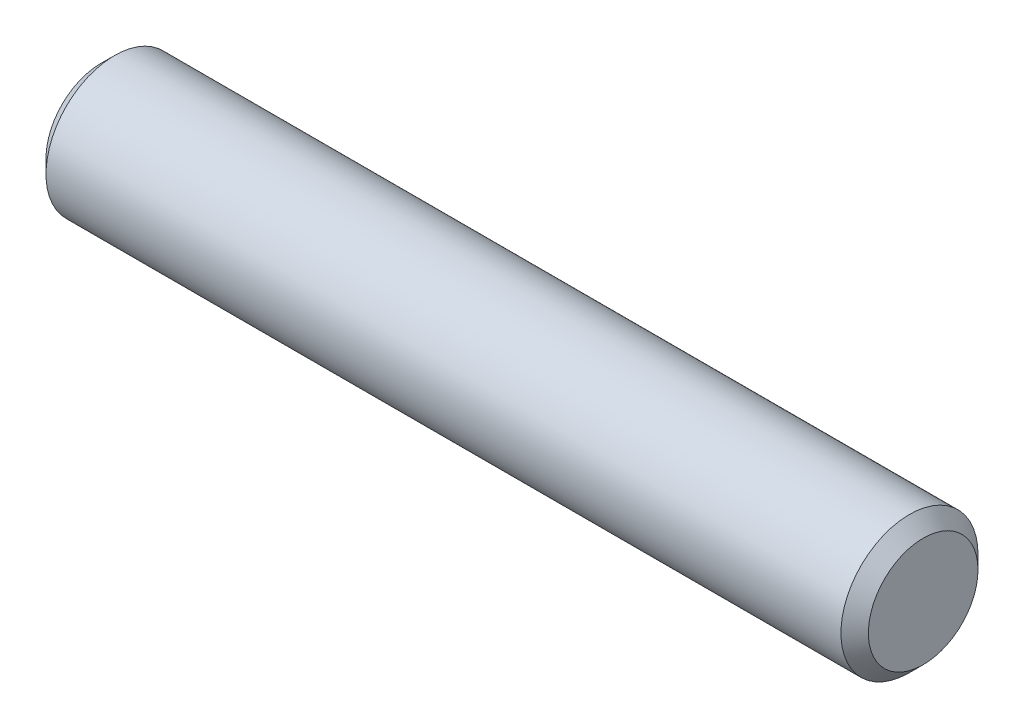
ISO-10303-21;
HEADER;
FILE_DESCRIPTION(('STEP AP214'),'2;1');
FILE_NAME('part.step','',(''),(''),'','','');
FILE_SCHEMA(('AUTOMOTIVE_DESIGN { 1 0 10303 214 1 1 1 1 }'));
ENDSEC;
DATA;
#1=APPLICATION_CONTEXT('core data for automotive mechanical design processes');
#2=APPLICATION_PROTOCOL_DEFINITION('international standard','automotive_design',2000,#1);
#3=PRODUCT_CONTEXT('',#1,'mechanical');
#4=PRODUCT('Part','Part','',(#3));
#5=PRODUCT_RELATED_PRODUCT_CATEGORY('part','',(#4));
#6=PRODUCT_DEFINITION_FORMATION('','',#4);
#7=PRODUCT_DEFINITION_CONTEXT('part definition',#1,'design');
#8=PRODUCT_DEFINITION('design','',#6,#7);
#9=PRODUCT_DEFINITION_SHAPE('','',#8);
#10=(LENGTH_UNIT() NAMED_UNIT(*) SI_UNIT(.MILLI.,.METRE.));
#11=(NAMED_UNIT(*) PLANE_ANGLE_UNIT() SI_UNIT($,.RADIAN.));
#12=(NAMED_UNIT(*) SI_UNIT($,.STERADIAN.) SOLID_ANGLE_UNIT());
#13=UNCERTAINTY_MEASURE_WITH_UNIT(LENGTH_MEASURE(1.E-05),#10,'distance_accuracy_value','');
#14=(GEOMETRIC_REPRESENTATION_CONTEXT(3) GLOBAL_UNCERTAINTY_ASSIGNED_CONTEXT((#13)) GLOBAL_UNIT_ASSIGNED_CONTEXT((#10,
#11,#12)) REPRESENTATION_CONTEXT('',''));
#15=CARTESIAN_POINT('',(0.,0.,0.));
#16=DIRECTION('',(0.,0.,1.));
#17=DIRECTION('',(1.,0.,0.));
#18=AXIS2_PLACEMENT_3D('',#15,#16,#17);
#19=CARTESIAN_POINT('',(-4.7625,0.,0.));
#20=DIRECTION('',(1.,0.,0.));
#21=DIRECTION('',(0.,0.,-1.));
#22=AXIS2_PLACEMENT_3D('',#19,#20,#21);
#23=CYLINDRICAL_SURFACE('',#22,0.79375);
#24=CARTESIAN_POINT('',(4.60375,0.,0.));
#25=DIRECTION('',(1.,0.,0.));
#26=DIRECTION('',(0.,0.,-1.));
#27=AXIS2_PLACEMENT_3D('',#24,#25,#26);
#28=CIRCLE('',#27,0.79375);
#29=CARTESIAN_POINT('',(4.60375,0.,-0.79375));
#30=VERTEX_POINT('',#29);
#31=EDGE_CURVE('E40',#30,#30,#28,.F.);
#32=ORIENTED_EDGE('',*,*,#31,.T.);
#33=EDGE_LOOP('',(#32));
#34=FACE_BOUND('',#33,.T.);
#35=CARTESIAN_POINT('',(-4.60375,0.,0.));
#36=DIRECTION('',(1.,0.,0.));
#37=DIRECTION('',(0.,0.,-1.));
#38=AXIS2_PLACEMENT_3D('',#35,#36,#37);
#39=CIRCLE('',#38,0.79375);
#40=CARTESIAN_POINT('',(-4.60375,0.,-0.79375));
#41=VERTEX_POINT('',#40);
#42=EDGE_CURVE('E44',#41,#41,#39,.T.);
#43=ORIENTED_EDGE('',*,*,#42,.T.);
#44=EDGE_LOOP('',(#43));
#45=FACE_BOUND('',#44,.T.);
#46=ADVANCED_FACE('F33',(#34,#45),#23,.T.);
#47=CARTESIAN_POINT('',(-4.7625,0.,0.));
#48=DIRECTION('',(1.,0.,0.));
#49=DIRECTION('',(0.,0.,-1.));
#50=AXIS2_PLACEMENT_3D('',#47,#48,#49);
#51=PLANE('',#50);
#52=CARTESIAN_POINT('',(-4.7625,0.,0.));
#53=DIRECTION('',(1.,0.,0.));
#54=DIRECTION('',(0.,0.,-1.));
#55=AXIS2_PLACEMENT_3D('',#52,#53,#54);
#56=CIRCLE('',#55,0.634999999999995);
#57=CARTESIAN_POINT('',(-4.7625,0.,-0.634999999999995));
#58=VERTEX_POINT('',#57);
#59=EDGE_CURVE('E10',#58,#58,#56,.F.);
#60=ORIENTED_EDGE('',*,*,#59,.T.);
#61=EDGE_LOOP('',(#60));
#62=FACE_BOUND('',#61,.T.);
#63=ADVANCED_FACE('F64',(#62),#51,.F.);
#64=CARTESIAN_POINT('',(4.7625,0.,0.));
#65=DIRECTION('',(1.,0.,0.));
#66=DIRECTION('',(0.,0.,-1.));
#67=AXIS2_PLACEMENT_3D('',#64,#65,#66);
#68=PLANE('',#67);
#69=CARTESIAN_POINT('',(4.7625,0.,0.));
#70=DIRECTION('',(1.,0.,0.));
#71=DIRECTION('',(0.,0.,-1.));
#72=AXIS2_PLACEMENT_3D('',#69,#70,#71);
#73=CIRCLE('',#72,0.635000000000002);
#74=CARTESIAN_POINT('',(4.7625,0.,-0.635000000000002));
#75=VERTEX_POINT('',#74);
#76=EDGE_CURVE('E48',#75,#75,#73,.T.);
#77=ORIENTED_EDGE('',*,*,#76,.T.);
#78=EDGE_LOOP('',(#77));
#79=FACE_BOUND('',#78,.T.);
#80=ADVANCED_FACE('F54',(#79),#68,.T.);
#81=CARTESIAN_POINT('',(4.7625,0.,0.));
#82=DIRECTION('',(-1.,0.,0.));
#83=DIRECTION('',(0.,0.,1.));
#84=AXIS2_PLACEMENT_3D('',#81,#82,#83);
#85=CONICAL_SURFACE('',#84,0.635000000000001,0.785398163397448);
#86=ORIENTED_EDGE('',*,*,#31,.F.);
#87=EDGE_LOOP('',(#86));
#88=FACE_BOUND('',#87,.T.);
#89=ORIENTED_EDGE('',*,*,#76,.F.);
#90=EDGE_LOOP('',(#89));
#91=FACE_BOUND('',#90,.T.);
#92=ADVANCED_FACE('F56',(#88,#91),#85,.T.);
#93=CARTESIAN_POINT('',(-4.60375,0.,0.));
#94=DIRECTION('',(1.,0.,0.));
#95=DIRECTION('',(0.,0.,-1.));
#96=AXIS2_PLACEMENT_3D('',#93,#94,#95);
#97=CONICAL_SURFACE('',#96,0.79375,0.785398163397454);
#98=ORIENTED_EDGE('',*,*,#59,.F.);
#99=EDGE_LOOP('',(#98));
#100=FACE_BOUND('',#99,.T.);
#101=ORIENTED_EDGE('',*,*,#42,.F.);
#102=EDGE_LOOP('',(#101));
#103=FACE_BOUND('',#102,.T.);
#104=ADVANCED_FACE('F35',(#100,#103),#97,.T.);
#105=CLOSED_SHELL('',(#46,#63,#80,#92,#104));
#106=MANIFOLD_SOLID_BREP('B2',#105);
#107=ADVANCED_BREP_SHAPE_REPRESENTATION('',(#18,#106),#14);
#108=SHAPE_DEFINITION_REPRESENTATION(#9,#107);
ENDSEC;
END-ISO-10303-21;
